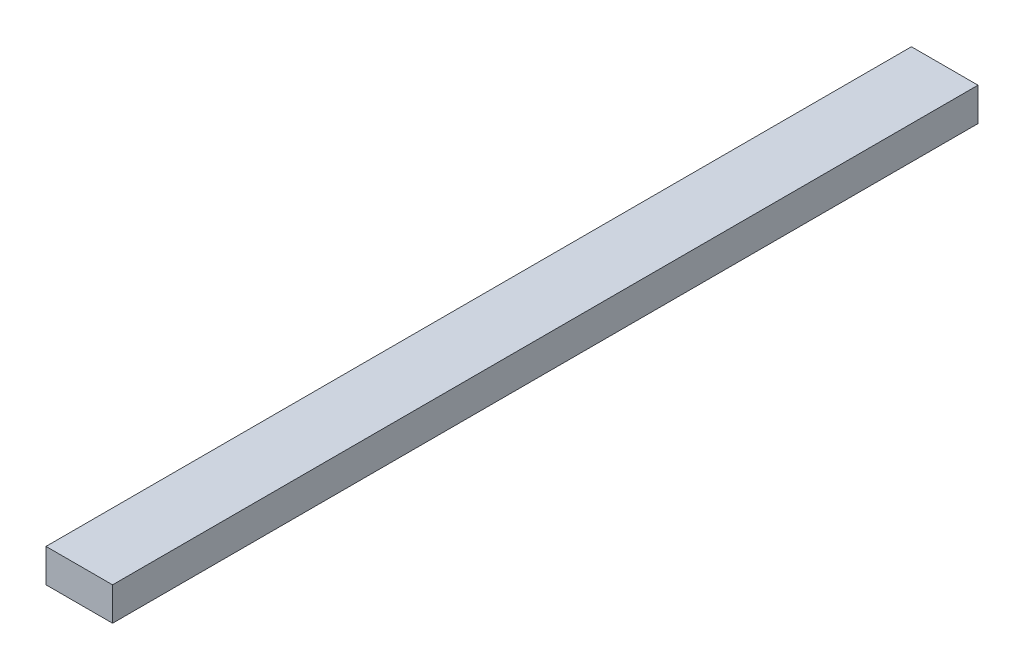
ISO-10303-21;
HEADER;
FILE_DESCRIPTION(('STEP AP214'),'2;1');
FILE_NAME('part.step','',(''),(''),'','','');
FILE_SCHEMA(('AUTOMOTIVE_DESIGN { 1 0 10303 214 1 1 1 1 }'));
ENDSEC;
DATA;
#1=APPLICATION_CONTEXT('core data for automotive mechanical design processes');
#2=APPLICATION_PROTOCOL_DEFINITION('international standard','automotive_design',2000,#1);
#3=PRODUCT_CONTEXT('',#1,'mechanical');
#4=PRODUCT('Part','Part','',(#3));
#5=PRODUCT_RELATED_PRODUCT_CATEGORY('part','',(#4));
#6=PRODUCT_DEFINITION_FORMATION('','',#4);
#7=PRODUCT_DEFINITION_CONTEXT('part definition',#1,'design');
#8=PRODUCT_DEFINITION('design','',#6,#7);
#9=PRODUCT_DEFINITION_SHAPE('','',#8);
#10=(LENGTH_UNIT() NAMED_UNIT(*) SI_UNIT(.MILLI.,.METRE.));
#11=(NAMED_UNIT(*) PLANE_ANGLE_UNIT() SI_UNIT($,.RADIAN.));
#12=(NAMED_UNIT(*) SI_UNIT($,.STERADIAN.) SOLID_ANGLE_UNIT());
#13=UNCERTAINTY_MEASURE_WITH_UNIT(LENGTH_MEASURE(1.E-05),#10,'distance_accuracy_value','');
#14=(GEOMETRIC_REPRESENTATION_CONTEXT(3) GLOBAL_UNCERTAINTY_ASSIGNED_CONTEXT((#13)) GLOBAL_UNIT_ASSIGNED_CONTEXT((#10,
#11,#12)) REPRESENTATION_CONTEXT('',''));
#15=CARTESIAN_POINT('',(0.,0.,0.));
#16=DIRECTION('',(0.,0.,1.));
#17=DIRECTION('',(1.,0.,0.));
#18=AXIS2_PLACEMENT_3D('',#15,#16,#17);
#19=CARTESIAN_POINT('',(0.,0.,660.4));
#20=DIRECTION('',(1.,0.,0.));
#21=DIRECTION('',(0.,1.,0.));
#22=AXIS2_PLACEMENT_3D('',#19,#20,#21);
#23=PLANE('',#22);
#24=DIRECTION('',(0.,-1.,0.));
#25=VECTOR('',#24,1.);
#26=CARTESIAN_POINT('',(0.,0.,0.));
#27=LINE('',#26,#25);
#28=CARTESIAN_POINT('',(0.,25.4,0.));
#29=VERTEX_POINT('',#28);
#30=CARTESIAN_POINT('',(0.,0.,0.));
#31=VERTEX_POINT('',#30);
#32=EDGE_CURVE('E113',#29,#31,#27,.T.);
#33=ORIENTED_EDGE('',*,*,#32,.T.);
#34=DIRECTION('',(0.,0.,-1.));
#35=VECTOR('',#34,1.);
#36=CARTESIAN_POINT('',(0.,0.,660.4));
#37=LINE('',#36,#35);
#38=CARTESIAN_POINT('',(0.,0.,660.4));
#39=VERTEX_POINT('',#38);
#40=EDGE_CURVE('E11',#39,#31,#37,.T.);
#41=ORIENTED_EDGE('',*,*,#40,.F.);
#42=DIRECTION('',(0.,-1.,0.));
#43=VECTOR('',#42,1.);
#44=CARTESIAN_POINT('',(0.,0.,660.4));
#45=LINE('',#44,#43);
#46=CARTESIAN_POINT('',(0.,25.4,660.4));
#47=VERTEX_POINT('',#46);
#48=EDGE_CURVE('E97',#47,#39,#45,.T.);
#49=ORIENTED_EDGE('',*,*,#48,.F.);
#50=DIRECTION('',(0.,0.,-1.));
#51=VECTOR('',#50,1.);
#52=CARTESIAN_POINT('',(0.,25.4,660.4));
#53=LINE('',#52,#51);
#54=EDGE_CURVE('E109',#47,#29,#53,.T.);
#55=ORIENTED_EDGE('',*,*,#54,.T.);
#56=EDGE_LOOP('',(#33,#41,#49,#55));
#57=FACE_BOUND('',#56,.T.);
#58=ADVANCED_FACE('F45',(#57),#23,.F.);
#59=CARTESIAN_POINT('',(0.,0.,660.4));
#60=DIRECTION('',(0.,1.,0.));
#61=DIRECTION('',(0.,0.,1.));
#62=AXIS2_PLACEMENT_3D('',#59,#60,#61);
#63=PLANE('',#62);
#64=DIRECTION('',(1.,0.,0.));
#65=VECTOR('',#64,1.);
#66=CARTESIAN_POINT('',(0.,0.,0.));
#67=LINE('',#66,#65);
#68=CARTESIAN_POINT('',(50.8,0.,0.));
#69=VERTEX_POINT('',#68);
#70=EDGE_CURVE('E102',#31,#69,#67,.T.);
#71=ORIENTED_EDGE('',*,*,#70,.T.);
#72=DIRECTION('',(0.,0.,-1.));
#73=VECTOR('',#72,1.);
#74=CARTESIAN_POINT('',(50.8,0.,660.4));
#75=LINE('',#74,#73);
#76=CARTESIAN_POINT('',(50.8,0.,660.4));
#77=VERTEX_POINT('',#76);
#78=EDGE_CURVE('E54',#77,#69,#75,.T.);
#79=ORIENTED_EDGE('',*,*,#78,.F.);
#80=DIRECTION('',(1.,0.,0.));
#81=VECTOR('',#80,1.);
#82=CARTESIAN_POINT('',(0.,0.,660.4));
#83=LINE('',#82,#81);
#84=EDGE_CURVE('E92',#39,#77,#83,.T.);
#85=ORIENTED_EDGE('',*,*,#84,.F.);
#86=ORIENTED_EDGE('',*,*,#40,.T.);
#87=EDGE_LOOP('',(#71,#79,#85,#86));
#88=FACE_BOUND('',#87,.T.);
#89=ADVANCED_FACE('F101',(#88),#63,.F.);
#90=CARTESIAN_POINT('',(50.8,0.,660.4));
#91=DIRECTION('',(-1.,0.,0.));
#92=DIRECTION('',(0.,-1.,0.));
#93=AXIS2_PLACEMENT_3D('',#90,#91,#92);
#94=PLANE('',#93);
#95=DIRECTION('',(0.,1.,0.));
#96=VECTOR('',#95,1.);
#97=CARTESIAN_POINT('',(50.8,0.,0.));
#98=LINE('',#97,#96);
#99=CARTESIAN_POINT('',(50.8,25.4,0.));
#100=VERTEX_POINT('',#99);
#101=EDGE_CURVE('E79',#69,#100,#98,.T.);
#102=ORIENTED_EDGE('',*,*,#101,.T.);
#103=DIRECTION('',(0.,0.,-1.));
#104=VECTOR('',#103,1.);
#105=CARTESIAN_POINT('',(50.8,25.4,660.4));
#106=LINE('',#105,#104);
#107=CARTESIAN_POINT('',(50.8,25.4,660.4));
#108=VERTEX_POINT('',#107);
#109=EDGE_CURVE('E104',#108,#100,#106,.T.);
#110=ORIENTED_EDGE('',*,*,#109,.F.);
#111=DIRECTION('',(0.,1.,0.));
#112=VECTOR('',#111,1.);
#113=CARTESIAN_POINT('',(50.8,0.,660.4));
#114=LINE('',#113,#112);
#115=EDGE_CURVE('E95',#77,#108,#114,.T.);
#116=ORIENTED_EDGE('',*,*,#115,.F.);
#117=ORIENTED_EDGE('',*,*,#78,.T.);
#118=EDGE_LOOP('',(#102,#110,#116,#117));
#119=FACE_BOUND('',#118,.T.);
#120=ADVANCED_FACE('F105',(#119),#94,.F.);
#121=CARTESIAN_POINT('',(0.,25.4,660.4));
#122=DIRECTION('',(0.,-1.,0.));
#123=DIRECTION('',(0.,0.,-1.));
#124=AXIS2_PLACEMENT_3D('',#121,#122,#123);
#125=PLANE('',#124);
#126=DIRECTION('',(-1.,0.,0.));
#127=VECTOR('',#126,1.);
#128=CARTESIAN_POINT('',(0.,25.4,0.));
#129=LINE('',#128,#127);
#130=EDGE_CURVE('E85',#100,#29,#129,.T.);
#131=ORIENTED_EDGE('',*,*,#130,.T.);
#132=ORIENTED_EDGE('',*,*,#54,.F.);
#133=DIRECTION('',(-1.,0.,0.));
#134=VECTOR('',#133,1.);
#135=CARTESIAN_POINT('',(0.,25.4,660.4));
#136=LINE('',#135,#134);
#137=EDGE_CURVE('E62',#108,#47,#136,.T.);
#138=ORIENTED_EDGE('',*,*,#137,.F.);
#139=ORIENTED_EDGE('',*,*,#109,.T.);
#140=EDGE_LOOP('',(#131,#132,#138,#139));
#141=FACE_BOUND('',#140,.T.);
#142=ADVANCED_FACE('F126',(#141),#125,.F.);
#143=CARTESIAN_POINT('',(0.,0.,660.4));
#144=DIRECTION('',(0.,0.,-1.));
#145=DIRECTION('',(-1.,0.,0.));
#146=AXIS2_PLACEMENT_3D('',#143,#144,#145);
#147=PLANE('',#146);
#148=ORIENTED_EDGE('',*,*,#48,.T.);
#149=ORIENTED_EDGE('',*,*,#84,.T.);
#150=ORIENTED_EDGE('',*,*,#115,.T.);
#151=ORIENTED_EDGE('',*,*,#137,.T.);
#152=EDGE_LOOP('',(#148,#149,#150,#151));
#153=FACE_BOUND('',#152,.T.);
#154=ADVANCED_FACE('F93',(#153),#147,.F.);
#155=CARTESIAN_POINT('',(0.,0.,0.));
#156=DIRECTION('',(0.,0.,-1.));
#157=DIRECTION('',(-1.,0.,0.));
#158=AXIS2_PLACEMENT_3D('',#155,#156,#157);
#159=PLANE('',#158);
#160=ORIENTED_EDGE('',*,*,#32,.F.);
#161=ORIENTED_EDGE('',*,*,#130,.F.);
#162=ORIENTED_EDGE('',*,*,#101,.F.);
#163=ORIENTED_EDGE('',*,*,#70,.F.);
#164=EDGE_LOOP('',(#160,#161,#162,#163));
#165=FACE_BOUND('',#164,.T.);
#166=ADVANCED_FACE('F129',(#165),#159,.T.);
#167=CLOSED_SHELL('',(#58,#89,#120,#142,#154,#166));
#168=MANIFOLD_SOLID_BREP('B2',#167);
#169=ADVANCED_BREP_SHAPE_REPRESENTATION('',(#18,#168),#14);
#170=SHAPE_DEFINITION_REPRESENTATION(#9,#169);
ENDSEC;
END-ISO-10303-21;
